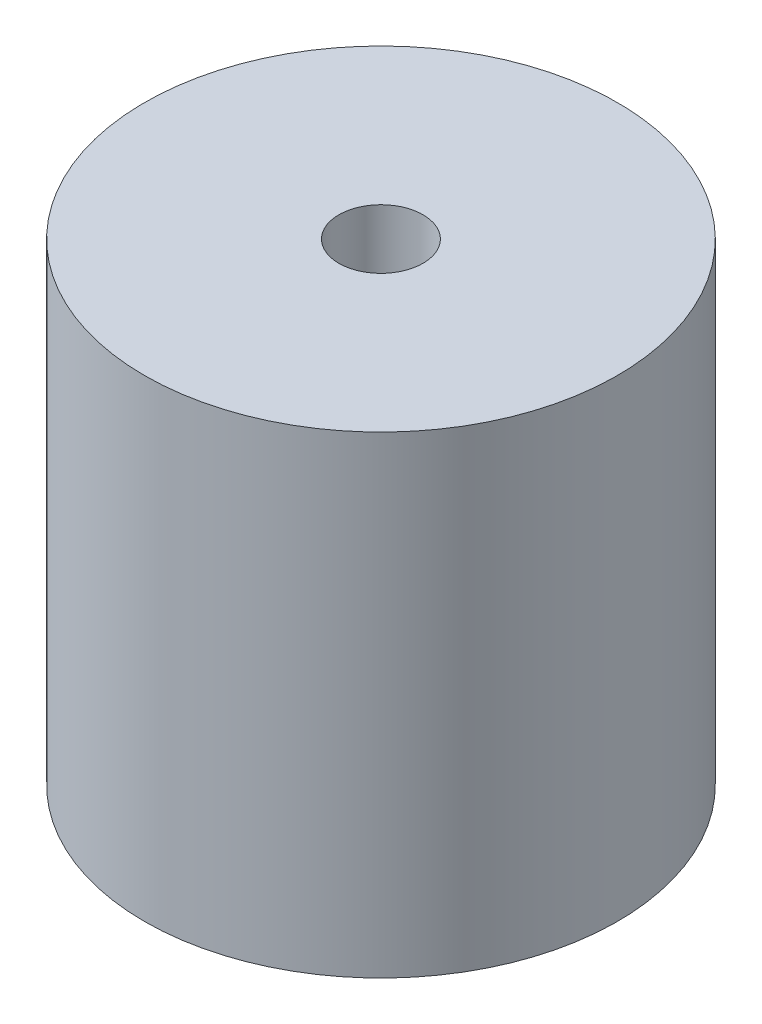
ISO-10303-21;
HEADER;
FILE_DESCRIPTION(('STEP AP214'),'2;1');
FILE_NAME('part.step','',(''),(''),'','','');
FILE_SCHEMA(('AUTOMOTIVE_DESIGN { 1 0 10303 214 1 1 1 1 }'));
ENDSEC;
DATA;
#1=APPLICATION_CONTEXT('core data for automotive mechanical design processes');
#2=APPLICATION_PROTOCOL_DEFINITION('international standard','automotive_design',2000,#1);
#3=PRODUCT_CONTEXT('',#1,'mechanical');
#4=PRODUCT('Part','Part','',(#3));
#5=PRODUCT_RELATED_PRODUCT_CATEGORY('part','',(#4));
#6=PRODUCT_DEFINITION_FORMATION('','',#4);
#7=PRODUCT_DEFINITION_CONTEXT('part definition',#1,'design');
#8=PRODUCT_DEFINITION('design','',#6,#7);
#9=PRODUCT_DEFINITION_SHAPE('','',#8);
#10=(LENGTH_UNIT() NAMED_UNIT(*) SI_UNIT(.MILLI.,.METRE.));
#11=(NAMED_UNIT(*) PLANE_ANGLE_UNIT() SI_UNIT($,.RADIAN.));
#12=(NAMED_UNIT(*) SI_UNIT($,.STERADIAN.) SOLID_ANGLE_UNIT());
#13=UNCERTAINTY_MEASURE_WITH_UNIT(LENGTH_MEASURE(1.E-05),#10,'distance_accuracy_value','');
#14=(GEOMETRIC_REPRESENTATION_CONTEXT(3) GLOBAL_UNCERTAINTY_ASSIGNED_CONTEXT((#13)) GLOBAL_UNIT_ASSIGNED_CONTEXT((#10,
#11,#12)) REPRESENTATION_CONTEXT('',''));
#15=CARTESIAN_POINT('',(0.,0.,0.));
#16=DIRECTION('',(0.,0.,1.));
#17=DIRECTION('',(1.,0.,0.));
#18=AXIS2_PLACEMENT_3D('',#15,#16,#17);
#19=CARTESIAN_POINT('',(0.,12.7,0.));
#20=DIRECTION('',(0.,-1.,0.));
#21=DIRECTION('',(0.,0.,-1.));
#22=AXIS2_PLACEMENT_3D('',#19,#20,#21);
#23=CYLINDRICAL_SURFACE('',#22,6.35);
#24=CARTESIAN_POINT('',(0.,12.7,0.));
#25=DIRECTION('',(0.,1.,0.));
#26=DIRECTION('',(0.,0.,1.));
#27=AXIS2_PLACEMENT_3D('',#24,#25,#26);
#28=CIRCLE('',#27,6.35);
#29=CARTESIAN_POINT('',(0.,12.7,6.35));
#30=VERTEX_POINT('',#29);
#31=EDGE_CURVE('E11',#30,#30,#28,.T.);
#32=ORIENTED_EDGE('',*,*,#31,.F.);
#33=EDGE_LOOP('',(#32));
#34=FACE_BOUND('',#33,.T.);
#35=CARTESIAN_POINT('',(0.,0.,0.));
#36=DIRECTION('',(0.,1.,0.));
#37=DIRECTION('',(0.,0.,1.));
#38=AXIS2_PLACEMENT_3D('',#35,#36,#37);
#39=CIRCLE('',#38,6.35);
#40=CARTESIAN_POINT('',(0.,0.,6.35));
#41=VERTEX_POINT('',#40);
#42=EDGE_CURVE('E48',#41,#41,#39,.T.);
#43=ORIENTED_EDGE('',*,*,#42,.T.);
#44=EDGE_LOOP('',(#43));
#45=FACE_BOUND('',#44,.T.);
#46=ADVANCED_FACE('F45',(#34,#45),#23,.T.);
#47=CARTESIAN_POINT('',(0.,12.7,0.));
#48=DIRECTION('',(0.,1.,0.));
#49=DIRECTION('',(0.,0.,1.));
#50=AXIS2_PLACEMENT_3D('',#47,#48,#49);
#51=PLANE('',#50);
#52=CARTESIAN_POINT('',(0.,12.7,0.));
#53=DIRECTION('',(0.,1.,0.));
#54=DIRECTION('',(0.,0.,1.));
#55=AXIS2_PLACEMENT_3D('',#52,#53,#54);
#56=CIRCLE('',#55,1.13029999999999);
#57=CARTESIAN_POINT('',(0.,12.7,1.13029999999999));
#58=VERTEX_POINT('',#57);
#59=EDGE_CURVE('E70',#58,#58,#56,.T.);
#60=ORIENTED_EDGE('',*,*,#59,.F.);
#61=EDGE_LOOP('',(#60));
#62=FACE_BOUND('',#61,.T.);
#63=ORIENTED_EDGE('',*,*,#31,.T.);
#64=EDGE_LOOP('',(#63));
#65=FACE_BOUND('',#64,.T.);
#66=ADVANCED_FACE('F93',(#62,#65),#51,.T.);
#67=CARTESIAN_POINT('',(0.,0.,0.));
#68=DIRECTION('',(0.,1.,0.));
#69=DIRECTION('',(0.,0.,1.));
#70=AXIS2_PLACEMENT_3D('',#67,#68,#69);
#71=PLANE('',#70);
#72=CARTESIAN_POINT('',(0.,0.,0.));
#73=DIRECTION('',(0.,-1.,0.));
#74=DIRECTION('',(0.,0.,-1.));
#75=AXIS2_PLACEMENT_3D('',#72,#73,#74);
#76=CIRCLE('',#75,2.7051);
#77=CARTESIAN_POINT('',(0.,0.,-2.7051));
#78=VERTEX_POINT('',#77);
#79=EDGE_CURVE('E71',#78,#78,#76,.T.);
#80=ORIENTED_EDGE('',*,*,#79,.F.);
#81=EDGE_LOOP('',(#80));
#82=FACE_BOUND('',#81,.T.);
#83=ORIENTED_EDGE('',*,*,#42,.F.);
#84=EDGE_LOOP('',(#83));
#85=FACE_BOUND('',#84,.T.);
#86=ADVANCED_FACE('F90',(#82,#85),#71,.F.);
#87=CARTESIAN_POINT('',(0.,9.144,0.));
#88=DIRECTION('',(0.,1.,0.));
#89=DIRECTION('',(0.,0.,1.));
#90=AXIS2_PLACEMENT_3D('',#87,#88,#89);
#91=CONICAL_SURFACE('',#90,1.1303,1.02974425867665);
#92=CARTESIAN_POINT('',(0.,8.46484724231315,0.));
#93=VERTEX_POINT('',#92);
#94=VERTEX_LOOP('',#93);
#95=FACE_BOUND('',#94,.T.);
#96=CARTESIAN_POINT('',(0.,9.144,0.));
#97=DIRECTION('',(0.,1.,0.));
#98=DIRECTION('',(0.,0.,1.));
#99=AXIS2_PLACEMENT_3D('',#96,#97,#98);
#100=CIRCLE('',#99,1.1303);
#101=CARTESIAN_POINT('',(0.,9.144,1.1303));
#102=VERTEX_POINT('',#101);
#103=EDGE_CURVE('E76',#102,#102,#100,.T.);
#104=ORIENTED_EDGE('',*,*,#103,.T.);
#105=EDGE_LOOP('',(#104));
#106=FACE_BOUND('',#105,.T.);
#107=ADVANCED_FACE('F92',(#95,#106),#91,.F.);
#108=CARTESIAN_POINT('',(0.,12.7,0.));
#109=DIRECTION('',(0.,1.,0.));
#110=DIRECTION('',(0.,0.,1.));
#111=AXIS2_PLACEMENT_3D('',#108,#109,#110);
#112=CYLINDRICAL_SURFACE('',#111,1.13029999999999);
#113=ORIENTED_EDGE('',*,*,#103,.F.);
#114=EDGE_LOOP('',(#113));
#115=FACE_BOUND('',#114,.T.);
#116=ORIENTED_EDGE('',*,*,#59,.T.);
#117=EDGE_LOOP('',(#116));
#118=FACE_BOUND('',#117,.T.);
#119=ADVANCED_FACE('F63',(#115,#118),#112,.F.);
#120=CARTESIAN_POINT('',(0.,6.,0.));
#121=DIRECTION('',(0.,-1.,0.));
#122=DIRECTION('',(0.,0.,-1.));
#123=AXIS2_PLACEMENT_3D('',#120,#121,#122);
#124=CONICAL_SURFACE('',#123,2.7051,1.02974425867665);
#125=CARTESIAN_POINT('',(0.,7.62538806053145,0.));
#126=VERTEX_POINT('',#125);
#127=VERTEX_LOOP('',#126);
#128=FACE_BOUND('',#127,.T.);
#129=CARTESIAN_POINT('',(0.,6.,0.));
#130=DIRECTION('',(0.,-1.,0.));
#131=DIRECTION('',(0.,0.,-1.));
#132=AXIS2_PLACEMENT_3D('',#129,#130,#131);
#133=CIRCLE('',#132,2.7051);
#134=CARTESIAN_POINT('',(0.,6.,-2.7051));
#135=VERTEX_POINT('',#134);
#136=EDGE_CURVE('E67',#135,#135,#133,.T.);
#137=ORIENTED_EDGE('',*,*,#136,.T.);
#138=EDGE_LOOP('',(#137));
#139=FACE_BOUND('',#138,.T.);
#140=ADVANCED_FACE('F59',(#128,#139),#124,.F.);
#141=CARTESIAN_POINT('',(0.,0.,0.));
#142=DIRECTION('',(0.,-1.,0.));
#143=DIRECTION('',(0.,0.,-1.));
#144=AXIS2_PLACEMENT_3D('',#141,#142,#143);
#145=CYLINDRICAL_SURFACE('',#144,2.7051);
#146=ORIENTED_EDGE('',*,*,#136,.F.);
#147=EDGE_LOOP('',(#146));
#148=FACE_BOUND('',#147,.T.);
#149=ORIENTED_EDGE('',*,*,#79,.T.);
#150=EDGE_LOOP('',(#149));
#151=FACE_BOUND('',#150,.T.);
#152=ADVANCED_FACE('F62',(#148,#151),#145,.F.);
#153=CLOSED_SHELL('',(#46,#66,#86,#107,#119,#140,#152));
#154=MANIFOLD_SOLID_BREP('B2',#153);
#155=ADVANCED_BREP_SHAPE_REPRESENTATION('',(#18,#154),#14);
#156=SHAPE_DEFINITION_REPRESENTATION(#9,#155);
ENDSEC;
END-ISO-10303-21;
